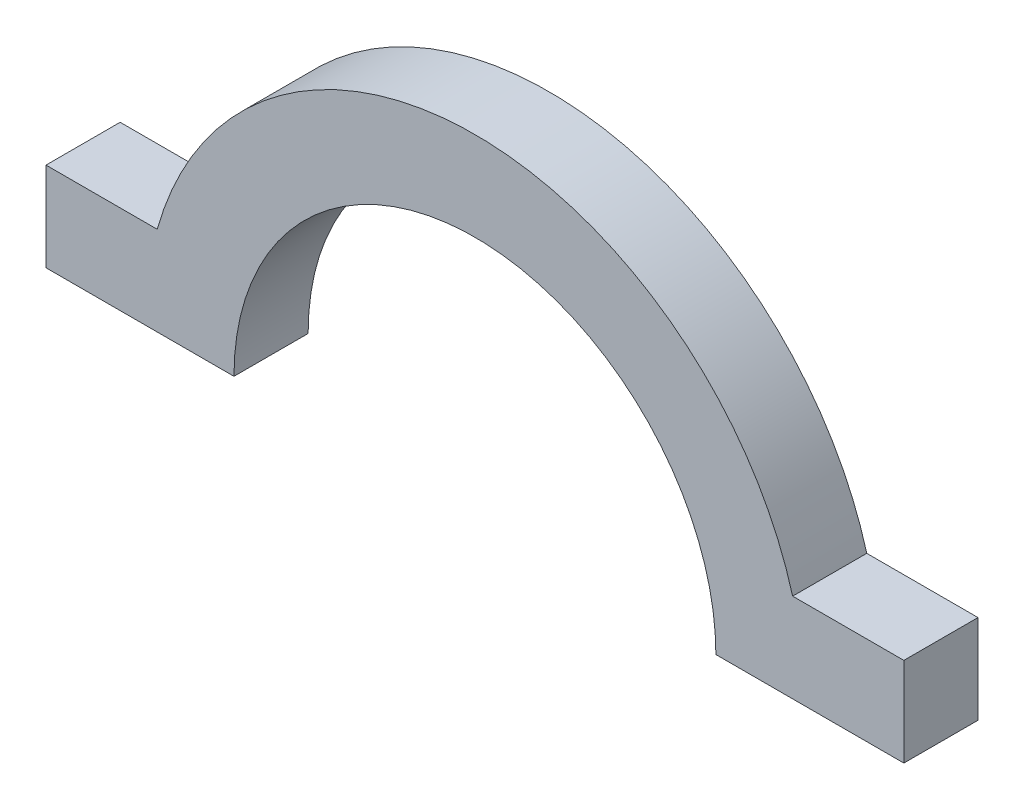
ISO-10303-21;
HEADER;
FILE_DESCRIPTION(('STEP AP214'),'2;1');
FILE_NAME('part.step','',(''),(''),'','','');
FILE_SCHEMA(('AUTOMOTIVE_DESIGN { 1 0 10303 214 1 1 1 1 }'));
ENDSEC;
DATA;
#1=APPLICATION_CONTEXT('core data for automotive mechanical design processes');
#2=APPLICATION_PROTOCOL_DEFINITION('international standard','automotive_design',2000,#1);
#3=PRODUCT_CONTEXT('',#1,'mechanical');
#4=PRODUCT('Part','Part','',(#3));
#5=PRODUCT_RELATED_PRODUCT_CATEGORY('part','',(#4));
#6=PRODUCT_DEFINITION_FORMATION('','',#4);
#7=PRODUCT_DEFINITION_CONTEXT('part definition',#1,'design');
#8=PRODUCT_DEFINITION('design','',#6,#7);
#9=PRODUCT_DEFINITION_SHAPE('','',#8);
#10=(LENGTH_UNIT() NAMED_UNIT(*) SI_UNIT(.MILLI.,.METRE.));
#11=(NAMED_UNIT(*) PLANE_ANGLE_UNIT() SI_UNIT($,.RADIAN.));
#12=(NAMED_UNIT(*) SI_UNIT($,.STERADIAN.) SOLID_ANGLE_UNIT());
#13=UNCERTAINTY_MEASURE_WITH_UNIT(LENGTH_MEASURE(1.E-05),#10,'distance_accuracy_value','');
#14=(GEOMETRIC_REPRESENTATION_CONTEXT(3) GLOBAL_UNCERTAINTY_ASSIGNED_CONTEXT((#13)) GLOBAL_UNIT_ASSIGNED_CONTEXT((#10,
#11,#12)) REPRESENTATION_CONTEXT('',''));
#15=CARTESIAN_POINT('',(0.,0.,0.));
#16=DIRECTION('',(0.,0.,1.));
#17=DIRECTION('',(1.,0.,0.));
#18=AXIS2_PLACEMENT_3D('',#15,#16,#17);
#19=CARTESIAN_POINT('',(57.8514877221317,0.,10.));
#20=DIRECTION('',(-1.,0.,0.));
#21=DIRECTION('',(0.,0.,1.));
#22=AXIS2_PLACEMENT_3D('',#19,#20,#21);
#23=PLANE('',#22);
#24=DIRECTION('',(0.,1.,0.));
#25=VECTOR('',#24,1.);
#26=CARTESIAN_POINT('',(57.8514877221317,0.,0.));
#27=LINE('',#26,#25);
#28=CARTESIAN_POINT('',(57.8514877221317,0.,0.));
#29=VERTEX_POINT('',#28);
#30=CARTESIAN_POINT('',(57.8514877221317,12.,0.));
#31=VERTEX_POINT('',#30);
#32=EDGE_CURVE('E140',#29,#31,#27,.T.);
#33=ORIENTED_EDGE('',*,*,#32,.T.);
#34=DIRECTION('',(0.,0.,-1.));
#35=VECTOR('',#34,1.);
#36=CARTESIAN_POINT('',(57.8514877221317,12.,10.));
#37=LINE('',#36,#35);
#38=CARTESIAN_POINT('',(57.8514877221317,12.,10.));
#39=VERTEX_POINT('',#38);
#40=EDGE_CURVE('E11',#39,#31,#37,.T.);
#41=ORIENTED_EDGE('',*,*,#40,.F.);
#42=DIRECTION('',(0.,1.,0.));
#43=VECTOR('',#42,1.);
#44=CARTESIAN_POINT('',(57.8514877221317,0.,10.));
#45=LINE('',#44,#43);
#46=CARTESIAN_POINT('',(57.8514877221317,0.,10.));
#47=VERTEX_POINT('',#46);
#48=EDGE_CURVE('E162',#47,#39,#45,.T.);
#49=ORIENTED_EDGE('',*,*,#48,.F.);
#50=DIRECTION('',(0.,0.,-1.));
#51=VECTOR('',#50,1.);
#52=CARTESIAN_POINT('',(57.8514877221317,0.,10.));
#53=LINE('',#52,#51);
#54=EDGE_CURVE('E136',#47,#29,#53,.T.);
#55=ORIENTED_EDGE('',*,*,#54,.T.);
#56=EDGE_LOOP('',(#33,#41,#49,#55));
#57=FACE_BOUND('',#56,.T.);
#58=ADVANCED_FACE('F39',(#57),#23,.F.);
#59=CARTESIAN_POINT('',(57.8514877221317,12.,10.));
#60=DIRECTION('',(0.,-1.,0.));
#61=DIRECTION('',(0.,0.,-1.));
#62=AXIS2_PLACEMENT_3D('',#59,#60,#61);
#63=PLANE('',#62);
#64=DIRECTION('',(-1.,0.,0.));
#65=VECTOR('',#64,1.);
#66=CARTESIAN_POINT('',(57.8514877221317,12.,0.));
#67=LINE('',#66,#65);
#68=CARTESIAN_POINT('',(42.8514877221317,12.,0.));
#69=VERTEX_POINT('',#68);
#70=EDGE_CURVE('E144',#31,#69,#67,.T.);
#71=ORIENTED_EDGE('',*,*,#70,.T.);
#72=DIRECTION('',(0.,0.,-1.));
#73=VECTOR('',#72,1.);
#74=CARTESIAN_POINT('',(42.8514877221317,12.,10.));
#75=LINE('',#74,#73);
#76=CARTESIAN_POINT('',(42.8514877221317,12.,10.));
#77=VERTEX_POINT('',#76);
#78=EDGE_CURVE('E48',#77,#69,#75,.T.);
#79=ORIENTED_EDGE('',*,*,#78,.F.);
#80=DIRECTION('',(-1.,0.,0.));
#81=VECTOR('',#80,1.);
#82=CARTESIAN_POINT('',(57.8514877221317,12.,10.));
#83=LINE('',#82,#81);
#84=EDGE_CURVE('E99',#39,#77,#83,.T.);
#85=ORIENTED_EDGE('',*,*,#84,.F.);
#86=ORIENTED_EDGE('',*,*,#40,.T.);
#87=EDGE_LOOP('',(#71,#79,#85,#86));
#88=FACE_BOUND('',#87,.T.);
#89=ADVANCED_FACE('F208',(#88),#63,.F.);
#90=CARTESIAN_POINT('',(0.,0.,10.));
#91=DIRECTION('',(0.,0.,-1.));
#92=DIRECTION('',(-1.,0.,0.));
#93=AXIS2_PLACEMENT_3D('',#90,#91,#92);
#94=CYLINDRICAL_SURFACE('',#93,44.5);
#95=CARTESIAN_POINT('',(0.,0.,0.));
#96=DIRECTION('',(0.,0.,1.));
#97=DIRECTION('',(1.,0.,0.));
#98=AXIS2_PLACEMENT_3D('',#95,#96,#97);
#99=CIRCLE('',#98,44.5);
#100=CARTESIAN_POINT('',(-42.8514877221317,12.,0.));
#101=VERTEX_POINT('',#100);
#102=EDGE_CURVE('E147',#69,#101,#99,.T.);
#103=ORIENTED_EDGE('',*,*,#102,.T.);
#104=DIRECTION('',(0.,0.,-1.));
#105=VECTOR('',#104,1.);
#106=CARTESIAN_POINT('',(-42.8514877221317,12.,10.));
#107=LINE('',#106,#105);
#108=CARTESIAN_POINT('',(-42.8514877221317,12.,10.));
#109=VERTEX_POINT('',#108);
#110=EDGE_CURVE('E173',#109,#101,#107,.T.);
#111=ORIENTED_EDGE('',*,*,#110,.F.);
#112=CARTESIAN_POINT('',(0.,0.,10.));
#113=DIRECTION('',(0.,0.,1.));
#114=DIRECTION('',(1.,0.,0.));
#115=AXIS2_PLACEMENT_3D('',#112,#113,#114);
#116=CIRCLE('',#115,44.5);
#117=EDGE_CURVE('E183',#77,#109,#116,.T.);
#118=ORIENTED_EDGE('',*,*,#117,.F.);
#119=ORIENTED_EDGE('',*,*,#78,.T.);
#120=EDGE_LOOP('',(#103,#111,#118,#119));
#121=FACE_BOUND('',#120,.T.);
#122=ADVANCED_FACE('F181',(#121),#94,.T.);
#123=CARTESIAN_POINT('',(-57.8514877221317,12.,10.));
#124=DIRECTION('',(0.,-1.,0.));
#125=DIRECTION('',(0.,0.,-1.));
#126=AXIS2_PLACEMENT_3D('',#123,#124,#125);
#127=PLANE('',#126);
#128=DIRECTION('',(-1.,0.,0.));
#129=VECTOR('',#128,1.);
#130=CARTESIAN_POINT('',(-57.8514877221317,12.,0.));
#131=LINE('',#130,#129);
#132=CARTESIAN_POINT('',(-57.8514877221317,12.,0.));
#133=VERTEX_POINT('',#132);
#134=EDGE_CURVE('E150',#101,#133,#131,.T.);
#135=ORIENTED_EDGE('',*,*,#134,.T.);
#136=DIRECTION('',(0.,0.,-1.));
#137=VECTOR('',#136,1.);
#138=CARTESIAN_POINT('',(-57.8514877221317,12.,10.));
#139=LINE('',#138,#137);
#140=CARTESIAN_POINT('',(-57.8514877221317,12.,10.));
#141=VERTEX_POINT('',#140);
#142=EDGE_CURVE('E169',#141,#133,#139,.T.);
#143=ORIENTED_EDGE('',*,*,#142,.F.);
#144=DIRECTION('',(-1.,0.,0.));
#145=VECTOR('',#144,1.);
#146=CARTESIAN_POINT('',(-57.8514877221317,12.,10.));
#147=LINE('',#146,#145);
#148=EDGE_CURVE('E196',#109,#141,#147,.T.);
#149=ORIENTED_EDGE('',*,*,#148,.F.);
#150=ORIENTED_EDGE('',*,*,#110,.T.);
#151=EDGE_LOOP('',(#135,#143,#149,#150));
#152=FACE_BOUND('',#151,.T.);
#153=ADVANCED_FACE('F191',(#152),#127,.F.);
#154=CARTESIAN_POINT('',(-57.8514877221317,0.,10.));
#155=DIRECTION('',(1.,0.,0.));
#156=DIRECTION('',(0.,0.,-1.));
#157=AXIS2_PLACEMENT_3D('',#154,#155,#156);
#158=PLANE('',#157);
#159=DIRECTION('',(0.,-1.,0.));
#160=VECTOR('',#159,1.);
#161=CARTESIAN_POINT('',(-57.8514877221317,0.,0.));
#162=LINE('',#161,#160);
#163=CARTESIAN_POINT('',(-57.8514877221317,0.,0.));
#164=VERTEX_POINT('',#163);
#165=EDGE_CURVE('E153',#133,#164,#162,.T.);
#166=ORIENTED_EDGE('',*,*,#165,.T.);
#167=DIRECTION('',(0.,0.,-1.));
#168=VECTOR('',#167,1.);
#169=CARTESIAN_POINT('',(-57.8514877221317,0.,10.));
#170=LINE('',#169,#168);
#171=CARTESIAN_POINT('',(-57.8514877221317,0.,10.));
#172=VERTEX_POINT('',#171);
#173=EDGE_CURVE('E129',#172,#164,#170,.T.);
#174=ORIENTED_EDGE('',*,*,#173,.F.);
#175=DIRECTION('',(0.,-1.,0.));
#176=VECTOR('',#175,1.);
#177=CARTESIAN_POINT('',(-57.8514877221317,0.,10.));
#178=LINE('',#177,#176);
#179=EDGE_CURVE('E118',#141,#172,#178,.T.);
#180=ORIENTED_EDGE('',*,*,#179,.F.);
#181=ORIENTED_EDGE('',*,*,#142,.T.);
#182=EDGE_LOOP('',(#166,#174,#180,#181));
#183=FACE_BOUND('',#182,.T.);
#184=ADVANCED_FACE('F194',(#183),#158,.F.);
#185=CARTESIAN_POINT('',(-32.5,0.,10.));
#186=DIRECTION('',(0.,1.,0.));
#187=DIRECTION('',(-1.,0.,0.));
#188=AXIS2_PLACEMENT_3D('',#185,#186,#187);
#189=PLANE('',#188);
#190=DIRECTION('',(1.,0.,0.));
#191=VECTOR('',#190,1.);
#192=CARTESIAN_POINT('',(-32.5,0.,0.));
#193=LINE('',#192,#191);
#194=CARTESIAN_POINT('',(-32.5,0.,0.));
#195=VERTEX_POINT('',#194);
#196=EDGE_CURVE('E127',#164,#195,#193,.T.);
#197=ORIENTED_EDGE('',*,*,#196,.T.);
#198=DIRECTION('',(0.,0.,-1.));
#199=VECTOR('',#198,1.);
#200=CARTESIAN_POINT('',(-32.5,0.,10.));
#201=LINE('',#200,#199);
#202=CARTESIAN_POINT('',(-32.5,0.,10.));
#203=VERTEX_POINT('',#202);
#204=EDGE_CURVE('E124',#203,#195,#201,.T.);
#205=ORIENTED_EDGE('',*,*,#204,.F.);
#206=DIRECTION('',(1.,0.,0.));
#207=VECTOR('',#206,1.);
#208=CARTESIAN_POINT('',(-32.5,0.,10.));
#209=LINE('',#208,#207);
#210=EDGE_CURVE('E112',#172,#203,#209,.T.);
#211=ORIENTED_EDGE('',*,*,#210,.F.);
#212=ORIENTED_EDGE('',*,*,#173,.T.);
#213=EDGE_LOOP('',(#197,#205,#211,#212));
#214=FACE_BOUND('',#213,.T.);
#215=ADVANCED_FACE('F125',(#214),#189,.F.);
#216=CARTESIAN_POINT('',(0.,0.,10.));
#217=DIRECTION('',(0.,0.,-1.));
#218=DIRECTION('',(-1.,0.,0.));
#219=AXIS2_PLACEMENT_3D('',#216,#217,#218);
#220=CYLINDRICAL_SURFACE('',#219,32.5);
#221=CARTESIAN_POINT('',(0.,0.,0.));
#222=DIRECTION('',(0.,0.,-1.));
#223=DIRECTION('',(1.,0.,0.));
#224=AXIS2_PLACEMENT_3D('',#221,#222,#223);
#225=CIRCLE('',#224,32.5);
#226=CARTESIAN_POINT('',(32.5,0.,0.));
#227=VERTEX_POINT('',#226);
#228=EDGE_CURVE('E85',#195,#227,#225,.T.);
#229=ORIENTED_EDGE('',*,*,#228,.T.);
#230=DIRECTION('',(0.,0.,-1.));
#231=VECTOR('',#230,1.);
#232=CARTESIAN_POINT('',(32.5,0.,10.));
#233=LINE('',#232,#231);
#234=CARTESIAN_POINT('',(32.5,0.,10.));
#235=VERTEX_POINT('',#234);
#236=EDGE_CURVE('E130',#235,#227,#233,.T.);
#237=ORIENTED_EDGE('',*,*,#236,.F.);
#238=CARTESIAN_POINT('',(0.,0.,10.));
#239=DIRECTION('',(0.,0.,-1.));
#240=DIRECTION('',(1.,0.,0.));
#241=AXIS2_PLACEMENT_3D('',#238,#239,#240);
#242=CIRCLE('',#241,32.5);
#243=EDGE_CURVE('E116',#203,#235,#242,.T.);
#244=ORIENTED_EDGE('',*,*,#243,.F.);
#245=ORIENTED_EDGE('',*,*,#204,.T.);
#246=EDGE_LOOP('',(#229,#237,#244,#245));
#247=FACE_BOUND('',#246,.T.);
#248=ADVANCED_FACE('F132',(#247),#220,.F.);
#249=CARTESIAN_POINT('',(32.5,0.,10.));
#250=DIRECTION('',(0.,1.,0.));
#251=DIRECTION('',(-1.,0.,0.));
#252=AXIS2_PLACEMENT_3D('',#249,#250,#251);
#253=PLANE('',#252);
#254=DIRECTION('',(1.,0.,0.));
#255=VECTOR('',#254,1.);
#256=CARTESIAN_POINT('',(32.5,0.,0.));
#257=LINE('',#256,#255);
#258=EDGE_CURVE('E91',#227,#29,#257,.T.);
#259=ORIENTED_EDGE('',*,*,#258,.T.);
#260=ORIENTED_EDGE('',*,*,#54,.F.);
#261=DIRECTION('',(1.,0.,0.));
#262=VECTOR('',#261,1.);
#263=CARTESIAN_POINT('',(32.5,0.,10.));
#264=LINE('',#263,#262);
#265=EDGE_CURVE('E56',#235,#47,#264,.T.);
#266=ORIENTED_EDGE('',*,*,#265,.F.);
#267=ORIENTED_EDGE('',*,*,#236,.T.);
#268=EDGE_LOOP('',(#259,#260,#266,#267));
#269=FACE_BOUND('',#268,.T.);
#270=ADVANCED_FACE('F224',(#269),#253,.F.);
#271=CARTESIAN_POINT('',(0.,0.,10.));
#272=DIRECTION('',(0.,0.,1.));
#273=DIRECTION('',(1.,0.,0.));
#274=AXIS2_PLACEMENT_3D('',#271,#272,#273);
#275=PLANE('',#274);
#276=ORIENTED_EDGE('',*,*,#48,.T.);
#277=ORIENTED_EDGE('',*,*,#84,.T.);
#278=ORIENTED_EDGE('',*,*,#117,.T.);
#279=ORIENTED_EDGE('',*,*,#148,.T.);
#280=ORIENTED_EDGE('',*,*,#179,.T.);
#281=ORIENTED_EDGE('',*,*,#210,.T.);
#282=ORIENTED_EDGE('',*,*,#243,.T.);
#283=ORIENTED_EDGE('',*,*,#265,.T.);
#284=EDGE_LOOP('',(#276,#277,#278,#279,#280,#281,#282,#283));
#285=FACE_BOUND('',#284,.T.);
#286=ADVANCED_FACE('F114',(#285),#275,.T.);
#287=CARTESIAN_POINT('',(0.,0.,0.));
#288=DIRECTION('',(0.,0.,1.));
#289=DIRECTION('',(1.,0.,0.));
#290=AXIS2_PLACEMENT_3D('',#287,#288,#289);
#291=PLANE('',#290);
#292=ORIENTED_EDGE('',*,*,#32,.F.);
#293=ORIENTED_EDGE('',*,*,#258,.F.);
#294=ORIENTED_EDGE('',*,*,#228,.F.);
#295=ORIENTED_EDGE('',*,*,#196,.F.);
#296=ORIENTED_EDGE('',*,*,#165,.F.);
#297=ORIENTED_EDGE('',*,*,#134,.F.);
#298=ORIENTED_EDGE('',*,*,#102,.F.);
#299=ORIENTED_EDGE('',*,*,#70,.F.);
#300=EDGE_LOOP('',(#292,#293,#294,#295,#296,#297,#298,#299));
#301=FACE_BOUND('',#300,.T.);
#302=ADVANCED_FACE('F187',(#301),#291,.F.);
#303=CLOSED_SHELL('',(#58,#89,#122,#153,#184,#215,#248,#270,#286,#302));
#304=MANIFOLD_SOLID_BREP('B2',#303);
#305=ADVANCED_BREP_SHAPE_REPRESENTATION('',(#18,#304),#14);
#306=SHAPE_DEFINITION_REPRESENTATION(#9,#305);
ENDSEC;
END-ISO-10303-21;
